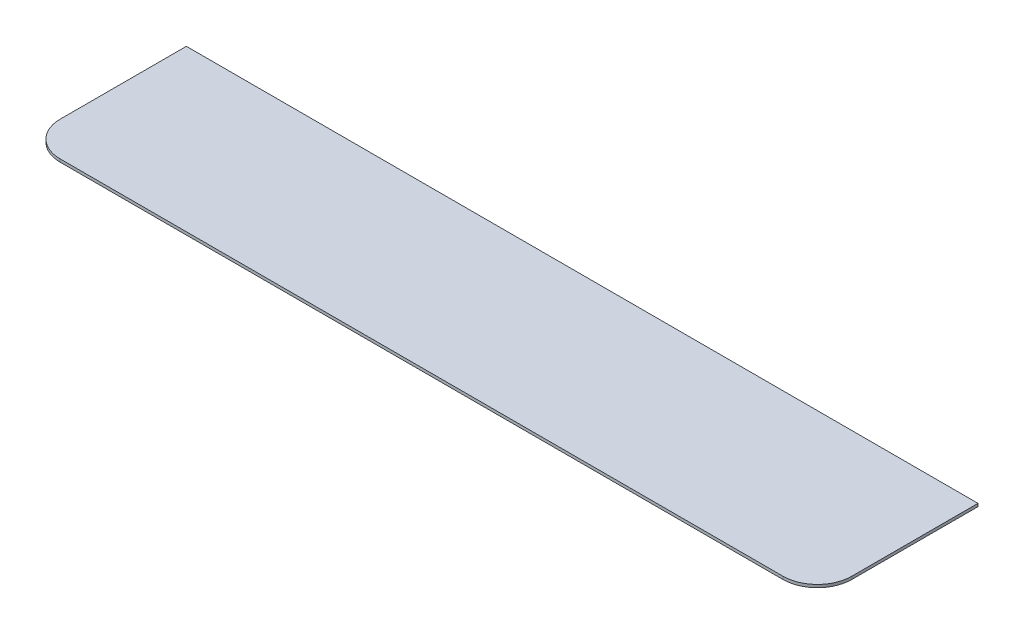
ISO-10303-21;
HEADER;
FILE_DESCRIPTION(('STEP AP214'),'2;1');
FILE_NAME('part.step','',(''),(''),'','','');
FILE_SCHEMA(('AUTOMOTIVE_DESIGN { 1 0 10303 214 1 1 1 1 }'));
ENDSEC;
DATA;
#1=APPLICATION_CONTEXT('core data for automotive mechanical design processes');
#2=APPLICATION_PROTOCOL_DEFINITION('international standard','automotive_design',2000,#1);
#3=PRODUCT_CONTEXT('',#1,'mechanical');
#4=PRODUCT('Part','Part','',(#3));
#5=PRODUCT_RELATED_PRODUCT_CATEGORY('part','',(#4));
#6=PRODUCT_DEFINITION_FORMATION('','',#4);
#7=PRODUCT_DEFINITION_CONTEXT('part definition',#1,'design');
#8=PRODUCT_DEFINITION('design','',#6,#7);
#9=PRODUCT_DEFINITION_SHAPE('','',#8);
#10=(LENGTH_UNIT() NAMED_UNIT(*) SI_UNIT(.MILLI.,.METRE.));
#11=(NAMED_UNIT(*) PLANE_ANGLE_UNIT() SI_UNIT($,.RADIAN.));
#12=(NAMED_UNIT(*) SI_UNIT($,.STERADIAN.) SOLID_ANGLE_UNIT());
#13=UNCERTAINTY_MEASURE_WITH_UNIT(LENGTH_MEASURE(1.E-05),#10,'distance_accuracy_value','');
#14=(GEOMETRIC_REPRESENTATION_CONTEXT(3) GLOBAL_UNCERTAINTY_ASSIGNED_CONTEXT((#13)) GLOBAL_UNIT_ASSIGNED_CONTEXT((#10,
#11,#12)) REPRESENTATION_CONTEXT('',''));
#15=CARTESIAN_POINT('',(0.,0.,0.));
#16=DIRECTION('',(0.,0.,1.));
#17=DIRECTION('',(1.,0.,0.));
#18=AXIS2_PLACEMENT_3D('',#15,#16,#17);
#19=CARTESIAN_POINT('',(0.,6.35,0.));
#20=DIRECTION('',(0.,1.,0.));
#21=DIRECTION('',(0.,0.,1.));
#22=AXIS2_PLACEMENT_3D('',#19,#20,#21);
#23=PLANE('',#22);
#24=DIRECTION('',(0.,0.,1.));
#25=VECTOR('',#24,1.);
#26=CARTESIAN_POINT('',(-1003.3,6.35,-177.8));
#27=LINE('',#26,#25);
#28=CARTESIAN_POINT('',(-1003.3,6.35,101.6));
#29=VERTEX_POINT('',#28);
#30=CARTESIAN_POINT('',(-1003.3,6.35,-177.8));
#31=VERTEX_POINT('',#30);
#32=EDGE_CURVE('E80',#29,#31,#27,.F.);
#33=ORIENTED_EDGE('',*,*,#32,.F.);
#34=CARTESIAN_POINT('',(-927.1,6.34999999999999,101.6));
#35=DIRECTION('',(0.,-1.,0.));
#36=DIRECTION('',(0.,0.,-1.));
#37=AXIS2_PLACEMENT_3D('',#34,#35,#36);
#38=CIRCLE('',#37,76.2);
#39=CARTESIAN_POINT('',(-927.1,6.35,177.8));
#40=VERTEX_POINT('',#39);
#41=EDGE_CURVE('E20',#40,#29,#38,.T.);
#42=ORIENTED_EDGE('',*,*,#41,.F.);
#43=DIRECTION('',(1.,0.,0.));
#44=VECTOR('',#43,1.);
#45=CARTESIAN_POINT('',(-1003.3,6.35,177.8));
#46=LINE('',#45,#44);
#47=CARTESIAN_POINT('',(673.1,6.35,177.8));
#48=VERTEX_POINT('',#47);
#49=EDGE_CURVE('E66',#48,#40,#46,.F.);
#50=ORIENTED_EDGE('',*,*,#49,.F.);
#51=CARTESIAN_POINT('',(673.1,6.34999999999999,101.6));
#52=DIRECTION('',(0.,-1.,0.));
#53=DIRECTION('',(0.,0.,-1.));
#54=AXIS2_PLACEMENT_3D('',#51,#52,#53);
#55=CIRCLE('',#54,76.2);
#56=CARTESIAN_POINT('',(749.3,6.35,101.6));
#57=VERTEX_POINT('',#56);
#58=EDGE_CURVE('E87',#57,#48,#55,.T.);
#59=ORIENTED_EDGE('',*,*,#58,.F.);
#60=DIRECTION('',(0.,0.,-1.));
#61=VECTOR('',#60,1.);
#62=CARTESIAN_POINT('',(749.3,6.35,177.8));
#63=LINE('',#62,#61);
#64=CARTESIAN_POINT('',(749.3,6.35,-177.8));
#65=VERTEX_POINT('',#64);
#66=EDGE_CURVE('E101',#65,#57,#63,.F.);
#67=ORIENTED_EDGE('',*,*,#66,.F.);
#68=DIRECTION('',(-1.,0.,0.));
#69=VECTOR('',#68,1.);
#70=CARTESIAN_POINT('',(749.3,6.35,-177.8));
#71=LINE('',#70,#69);
#72=EDGE_CURVE('E96',#31,#65,#71,.F.);
#73=ORIENTED_EDGE('',*,*,#72,.F.);
#74=EDGE_LOOP('',(#33,#42,#50,#59,#67,#73));
#75=FACE_BOUND('',#74,.T.);
#76=ADVANCED_FACE('F17',(#75),#23,.T.);
#77=CARTESIAN_POINT('',(-927.1,98.6155,101.6));
#78=DIRECTION('',(0.,-1.,0.));
#79=DIRECTION('',(0.,0.,-1.));
#80=AXIS2_PLACEMENT_3D('',#77,#78,#79);
#81=CYLINDRICAL_SURFACE('',#80,76.2);
#82=DIRECTION('',(0.,1.,0.));
#83=VECTOR('',#82,1.);
#84=CARTESIAN_POINT('',(-1003.3,0.,101.6));
#85=LINE('',#84,#83);
#86=CARTESIAN_POINT('',(-1003.3,0.,101.6));
#87=VERTEX_POINT('',#86);
#88=EDGE_CURVE('E110',#87,#29,#85,.T.);
#89=ORIENTED_EDGE('',*,*,#88,.F.);
#90=CARTESIAN_POINT('',(-927.1,0.,101.6));
#91=DIRECTION('',(0.,-1.,0.));
#92=DIRECTION('',(0.,0.,-1.));
#93=AXIS2_PLACEMENT_3D('',#90,#91,#92);
#94=CIRCLE('',#93,76.2);
#95=CARTESIAN_POINT('',(-927.1,0.,177.8));
#96=VERTEX_POINT('',#95);
#97=EDGE_CURVE('E86',#87,#96,#94,.F.);
#98=ORIENTED_EDGE('',*,*,#97,.T.);
#99=DIRECTION('',(0.,1.,0.));
#100=VECTOR('',#99,1.);
#101=CARTESIAN_POINT('',(-927.1,0.,177.8));
#102=LINE('',#101,#100);
#103=EDGE_CURVE('E71',#40,#96,#102,.F.);
#104=ORIENTED_EDGE('',*,*,#103,.F.);
#105=ORIENTED_EDGE('',*,*,#41,.T.);
#106=EDGE_LOOP('',(#89,#98,#104,#105));
#107=FACE_BOUND('',#106,.T.);
#108=ADVANCED_FACE('F85',(#107),#81,.T.);
#109=CARTESIAN_POINT('',(-1003.3,0.,177.8));
#110=DIRECTION('',(0.,0.,1.));
#111=DIRECTION('',(1.,0.,0.));
#112=AXIS2_PLACEMENT_3D('',#109,#110,#111);
#113=PLANE('',#112);
#114=ORIENTED_EDGE('',*,*,#49,.T.);
#115=ORIENTED_EDGE('',*,*,#103,.T.);
#116=DIRECTION('',(1.,0.,0.));
#117=VECTOR('',#116,1.);
#118=CARTESIAN_POINT('',(0.,0.,177.8));
#119=LINE('',#118,#117);
#120=CARTESIAN_POINT('',(673.1,0.,177.8));
#121=VERTEX_POINT('',#120);
#122=EDGE_CURVE('E109',#96,#121,#119,.T.);
#123=ORIENTED_EDGE('',*,*,#122,.T.);
#124=DIRECTION('',(0.,-1.,0.));
#125=VECTOR('',#124,1.);
#126=CARTESIAN_POINT('',(673.1,98.6155,177.8));
#127=LINE('',#126,#125);
#128=EDGE_CURVE('E73',#48,#121,#127,.T.);
#129=ORIENTED_EDGE('',*,*,#128,.F.);
#130=EDGE_LOOP('',(#114,#115,#123,#129));
#131=FACE_BOUND('',#130,.T.);
#132=ADVANCED_FACE('F68',(#131),#113,.T.);
#133=CARTESIAN_POINT('',(673.1,98.6155,101.6));
#134=DIRECTION('',(0.,-1.,0.));
#135=DIRECTION('',(0.,0.,-1.));
#136=AXIS2_PLACEMENT_3D('',#133,#134,#135);
#137=CYLINDRICAL_SURFACE('',#136,76.2);
#138=ORIENTED_EDGE('',*,*,#128,.T.);
#139=CARTESIAN_POINT('',(673.1,0.,101.6));
#140=DIRECTION('',(0.,-1.,0.));
#141=DIRECTION('',(0.,0.,-1.));
#142=AXIS2_PLACEMENT_3D('',#139,#140,#141);
#143=CIRCLE('',#142,76.2);
#144=CARTESIAN_POINT('',(749.3,0.,101.6));
#145=VERTEX_POINT('',#144);
#146=EDGE_CURVE('E105',#121,#145,#143,.F.);
#147=ORIENTED_EDGE('',*,*,#146,.T.);
#148=DIRECTION('',(0.,1.,0.));
#149=VECTOR('',#148,1.);
#150=CARTESIAN_POINT('',(749.3,0.,101.6));
#151=LINE('',#150,#149);
#152=EDGE_CURVE('E98',#57,#145,#151,.F.);
#153=ORIENTED_EDGE('',*,*,#152,.F.);
#154=ORIENTED_EDGE('',*,*,#58,.T.);
#155=EDGE_LOOP('',(#138,#147,#153,#154));
#156=FACE_BOUND('',#155,.T.);
#157=ADVANCED_FACE('F137',(#156),#137,.T.);
#158=CARTESIAN_POINT('',(749.3,0.,177.8));
#159=DIRECTION('',(1.,0.,0.));
#160=DIRECTION('',(0.,0.,-1.));
#161=AXIS2_PLACEMENT_3D('',#158,#159,#160);
#162=PLANE('',#161);
#163=ORIENTED_EDGE('',*,*,#66,.T.);
#164=ORIENTED_EDGE('',*,*,#152,.T.);
#165=DIRECTION('',(0.,0.,1.));
#166=VECTOR('',#165,1.);
#167=CARTESIAN_POINT('',(749.3,0.,0.));
#168=LINE('',#167,#166);
#169=CARTESIAN_POINT('',(749.3,0.,-177.8));
#170=VERTEX_POINT('',#169);
#171=EDGE_CURVE('E108',#145,#170,#168,.F.);
#172=ORIENTED_EDGE('',*,*,#171,.T.);
#173=DIRECTION('',(0.,1.,0.));
#174=VECTOR('',#173,1.);
#175=CARTESIAN_POINT('',(749.3,0.,-177.8));
#176=LINE('',#175,#174);
#177=EDGE_CURVE('E93',#65,#170,#176,.F.);
#178=ORIENTED_EDGE('',*,*,#177,.F.);
#179=EDGE_LOOP('',(#163,#164,#172,#178));
#180=FACE_BOUND('',#179,.T.);
#181=ADVANCED_FACE('F128',(#180),#162,.T.);
#182=CARTESIAN_POINT('',(749.3,0.,-177.8));
#183=DIRECTION('',(0.,0.,-1.));
#184=DIRECTION('',(-1.,0.,0.));
#185=AXIS2_PLACEMENT_3D('',#182,#183,#184);
#186=PLANE('',#185);
#187=ORIENTED_EDGE('',*,*,#177,.T.);
#188=DIRECTION('',(1.,0.,0.));
#189=VECTOR('',#188,1.);
#190=CARTESIAN_POINT('',(0.,0.,-177.8));
#191=LINE('',#190,#189);
#192=CARTESIAN_POINT('',(-1003.3,0.,-177.8));
#193=VERTEX_POINT('',#192);
#194=EDGE_CURVE('E26',#170,#193,#191,.F.);
#195=ORIENTED_EDGE('',*,*,#194,.T.);
#196=DIRECTION('',(0.,1.,0.));
#197=VECTOR('',#196,1.);
#198=CARTESIAN_POINT('',(-1003.3,0.,-177.8));
#199=LINE('',#198,#197);
#200=EDGE_CURVE('E34',#31,#193,#199,.F.);
#201=ORIENTED_EDGE('',*,*,#200,.F.);
#202=ORIENTED_EDGE('',*,*,#72,.T.);
#203=EDGE_LOOP('',(#187,#195,#201,#202));
#204=FACE_BOUND('',#203,.T.);
#205=ADVANCED_FACE('F139',(#204),#186,.T.);
#206=CARTESIAN_POINT('',(-1003.3,0.,-177.8));
#207=DIRECTION('',(-1.,0.,0.));
#208=DIRECTION('',(0.,0.,1.));
#209=AXIS2_PLACEMENT_3D('',#206,#207,#208);
#210=PLANE('',#209);
#211=DIRECTION('',(0.,0.,1.));
#212=VECTOR('',#211,1.);
#213=CARTESIAN_POINT('',(-1003.3,0.,0.));
#214=LINE('',#213,#212);
#215=EDGE_CURVE('E11',#193,#87,#214,.T.);
#216=ORIENTED_EDGE('',*,*,#215,.T.);
#217=ORIENTED_EDGE('',*,*,#88,.T.);
#218=ORIENTED_EDGE('',*,*,#32,.T.);
#219=ORIENTED_EDGE('',*,*,#200,.T.);
#220=EDGE_LOOP('',(#216,#217,#218,#219));
#221=FACE_BOUND('',#220,.T.);
#222=ADVANCED_FACE('F141',(#221),#210,.T.);
#223=CARTESIAN_POINT('',(0.,0.,0.));
#224=DIRECTION('',(0.,1.,0.));
#225=DIRECTION('',(0.,0.,1.));
#226=AXIS2_PLACEMENT_3D('',#223,#224,#225);
#227=PLANE('',#226);
#228=ORIENTED_EDGE('',*,*,#194,.F.);
#229=ORIENTED_EDGE('',*,*,#171,.F.);
#230=ORIENTED_EDGE('',*,*,#146,.F.);
#231=ORIENTED_EDGE('',*,*,#122,.F.);
#232=ORIENTED_EDGE('',*,*,#97,.F.);
#233=ORIENTED_EDGE('',*,*,#215,.F.);
#234=EDGE_LOOP('',(#228,#229,#230,#231,#232,#233));
#235=FACE_BOUND('',#234,.T.);
#236=ADVANCED_FACE('F135',(#235),#227,.F.);
#237=CLOSED_SHELL('',(#76,#108,#132,#157,#181,#205,#222,#236));
#238=MANIFOLD_SOLID_BREP('B1',#237);
#239=ADVANCED_BREP_SHAPE_REPRESENTATION('',(#18,#238),#14);
#240=SHAPE_DEFINITION_REPRESENTATION(#9,#239);
ENDSEC;
END-ISO-10303-21;
